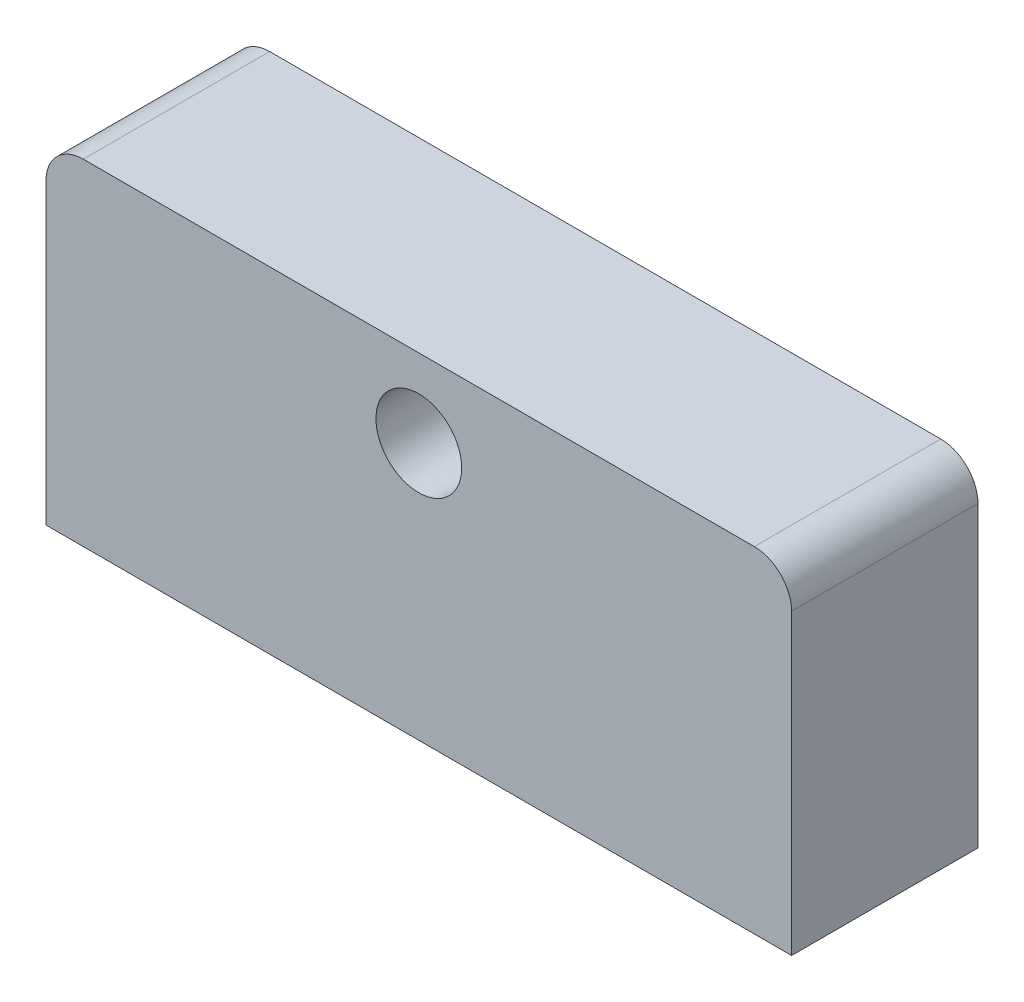
ISO-10303-21;
HEADER;
FILE_DESCRIPTION(('STEP AP214'),'2;1');
FILE_NAME('part.step','',(''),(''),'','','');
FILE_SCHEMA(('AUTOMOTIVE_DESIGN { 1 0 10303 214 1 1 1 1 }'));
ENDSEC;
DATA;
#1=APPLICATION_CONTEXT('core data for automotive mechanical design processes');
#2=APPLICATION_PROTOCOL_DEFINITION('international standard','automotive_design',2000,#1);
#3=PRODUCT_CONTEXT('',#1,'mechanical');
#4=PRODUCT('Part','Part','',(#3));
#5=PRODUCT_RELATED_PRODUCT_CATEGORY('part','',(#4));
#6=PRODUCT_DEFINITION_FORMATION('','',#4);
#7=PRODUCT_DEFINITION_CONTEXT('part definition',#1,'design');
#8=PRODUCT_DEFINITION('design','',#6,#7);
#9=PRODUCT_DEFINITION_SHAPE('','',#8);
#10=(LENGTH_UNIT() NAMED_UNIT(*) SI_UNIT(.MILLI.,.METRE.));
#11=(NAMED_UNIT(*) PLANE_ANGLE_UNIT() SI_UNIT($,.RADIAN.));
#12=(NAMED_UNIT(*) SI_UNIT($,.STERADIAN.) SOLID_ANGLE_UNIT());
#13=UNCERTAINTY_MEASURE_WITH_UNIT(LENGTH_MEASURE(1.E-05),#10,'distance_accuracy_value','');
#14=(GEOMETRIC_REPRESENTATION_CONTEXT(3) GLOBAL_UNCERTAINTY_ASSIGNED_CONTEXT((#13)) GLOBAL_UNIT_ASSIGNED_CONTEXT((#10,
#11,#12)) REPRESENTATION_CONTEXT('',''));
#15=CARTESIAN_POINT('',(0.,0.,0.));
#16=DIRECTION('',(0.,0.,1.));
#17=DIRECTION('',(1.,0.,0.));
#18=AXIS2_PLACEMENT_3D('',#15,#16,#17);
#19=CARTESIAN_POINT('',(0.,0.,25.));
#20=DIRECTION('',(0.,0.,-1.));
#21=DIRECTION('',(-1.,0.,0.));
#22=AXIS2_PLACEMENT_3D('',#19,#20,#21);
#23=PLANE('',#22);
#24=DIRECTION('',(-1.,0.,0.));
#25=VECTOR('',#24,1.);
#26=CARTESIAN_POINT('',(100.,45.,25.));
#27=LINE('',#26,#25);
#28=CARTESIAN_POINT('',(90.,45.,25.));
#29=VERTEX_POINT('',#28);
#30=CARTESIAN_POINT('',(-90.,45.,25.));
#31=VERTEX_POINT('',#30);
#32=EDGE_CURVE('E128',#29,#31,#27,.T.);
#33=ORIENTED_EDGE('',*,*,#32,.T.);
#34=CARTESIAN_POINT('',(-90.,35.,25.));
#35=DIRECTION('',(0.,0.,-1.));
#36=DIRECTION('',(-1.,0.,0.));
#37=AXIS2_PLACEMENT_3D('',#34,#35,#36);
#38=CIRCLE('',#37,10.);
#39=CARTESIAN_POINT('',(-100.,35.,25.));
#40=VERTEX_POINT('',#39);
#41=EDGE_CURVE('E61',#31,#40,#38,.F.);
#42=ORIENTED_EDGE('',*,*,#41,.T.);
#43=DIRECTION('',(0.,1.,0.));
#44=VECTOR('',#43,1.);
#45=CARTESIAN_POINT('',(-100.,-45.,25.));
#46=LINE('',#45,#44);
#47=CARTESIAN_POINT('',(-100.,-45.,25.));
#48=VERTEX_POINT('',#47);
#49=EDGE_CURVE('E112',#48,#40,#46,.T.);
#50=ORIENTED_EDGE('',*,*,#49,.F.);
#51=DIRECTION('',(-1.,0.,0.));
#52=VECTOR('',#51,1.);
#53=CARTESIAN_POINT('',(100.,-45.,25.));
#54=LINE('',#53,#52);
#55=CARTESIAN_POINT('',(100.,-45.,25.));
#56=VERTEX_POINT('',#55);
#57=EDGE_CURVE('E126',#56,#48,#54,.T.);
#58=ORIENTED_EDGE('',*,*,#57,.F.);
#59=DIRECTION('',(0.,1.,0.));
#60=VECTOR('',#59,1.);
#61=CARTESIAN_POINT('',(100.,-45.,25.));
#62=LINE('',#61,#60);
#63=CARTESIAN_POINT('',(100.,35.,25.));
#64=VERTEX_POINT('',#63);
#65=EDGE_CURVE('E131',#56,#64,#62,.T.);
#66=ORIENTED_EDGE('',*,*,#65,.T.);
#67=CARTESIAN_POINT('',(90.,35.,25.));
#68=DIRECTION('',(0.,0.,-1.));
#69=DIRECTION('',(-1.,0.,0.));
#70=AXIS2_PLACEMENT_3D('',#67,#68,#69);
#71=CIRCLE('',#70,10.);
#72=EDGE_CURVE('E154',#64,#29,#71,.F.);
#73=ORIENTED_EDGE('',*,*,#72,.T.);
#74=EDGE_LOOP('',(#33,#42,#50,#58,#66,#73));
#75=FACE_BOUND('',#74,.T.);
#76=CARTESIAN_POINT('',(0.,24.,25.));
#77=DIRECTION('',(0.,0.,1.));
#78=DIRECTION('',(1.,0.,0.));
#79=AXIS2_PLACEMENT_3D('',#76,#77,#78);
#80=CIRCLE('',#79,11.5);
#81=CARTESIAN_POINT('',(11.5,24.,25.));
#82=VERTEX_POINT('',#81);
#83=EDGE_CURVE('E138',#82,#82,#80,.T.);
#84=ORIENTED_EDGE('',*,*,#83,.F.);
#85=EDGE_LOOP('',(#84));
#86=FACE_BOUND('',#85,.T.);
#87=ADVANCED_FACE('F53',(#75,#86),#23,.F.);
#88=CARTESIAN_POINT('',(0.,0.,-25.));
#89=DIRECTION('',(0.,0.,-1.));
#90=DIRECTION('',(-1.,0.,0.));
#91=AXIS2_PLACEMENT_3D('',#88,#89,#90);
#92=PLANE('',#91);
#93=CARTESIAN_POINT('',(15.5,39.5,-25.));
#94=DIRECTION('',(0.,0.,-1.));
#95=DIRECTION('',(-1.,0.,0.));
#96=AXIS2_PLACEMENT_3D('',#93,#94,#95);
#97=CIRCLE('',#96,1.75);
#98=CARTESIAN_POINT('',(13.75,39.5,-25.));
#99=VERTEX_POINT('',#98);
#100=EDGE_CURVE('E236',#99,#99,#97,.T.);
#101=ORIENTED_EDGE('',*,*,#100,.F.);
#102=EDGE_LOOP('',(#101));
#103=FACE_BOUND('',#102,.T.);
#104=CARTESIAN_POINT('',(-15.5,39.5,-25.));
#105=DIRECTION('',(0.,0.,-1.));
#106=DIRECTION('',(-1.,0.,0.));
#107=AXIS2_PLACEMENT_3D('',#104,#105,#106);
#108=CIRCLE('',#107,1.75);
#109=CARTESIAN_POINT('',(-17.25,39.5,-25.));
#110=VERTEX_POINT('',#109);
#111=EDGE_CURVE('E261',#110,#110,#108,.T.);
#112=ORIENTED_EDGE('',*,*,#111,.F.);
#113=EDGE_LOOP('',(#112));
#114=FACE_BOUND('',#113,.T.);
#115=CARTESIAN_POINT('',(-15.5,8.50000000000001,-25.));
#116=DIRECTION('',(0.,0.,-1.));
#117=DIRECTION('',(-1.,0.,0.));
#118=AXIS2_PLACEMENT_3D('',#115,#116,#117);
#119=CIRCLE('',#118,1.75);
#120=CARTESIAN_POINT('',(-17.25,8.50000000000001,-25.));
#121=VERTEX_POINT('',#120);
#122=EDGE_CURVE('E255',#121,#121,#119,.T.);
#123=ORIENTED_EDGE('',*,*,#122,.F.);
#124=EDGE_LOOP('',(#123));
#125=FACE_BOUND('',#124,.T.);
#126=CARTESIAN_POINT('',(15.5,8.50000000000001,-25.));
#127=DIRECTION('',(0.,0.,-1.));
#128=DIRECTION('',(-1.,0.,0.));
#129=AXIS2_PLACEMENT_3D('',#126,#127,#128);
#130=CIRCLE('',#129,1.75);
#131=CARTESIAN_POINT('',(13.75,8.50000000000001,-25.));
#132=VERTEX_POINT('',#131);
#133=EDGE_CURVE('E254',#132,#132,#130,.T.);
#134=ORIENTED_EDGE('',*,*,#133,.F.);
#135=EDGE_LOOP('',(#134));
#136=FACE_BOUND('',#135,.T.);
#137=DIRECTION('',(0.,1.,0.));
#138=VECTOR('',#137,1.);
#139=CARTESIAN_POINT('',(-100.,-45.,-25.));
#140=LINE('',#139,#138);
#141=CARTESIAN_POINT('',(-100.,-45.,-25.));
#142=VERTEX_POINT('',#141);
#143=CARTESIAN_POINT('',(-100.,35.,-25.));
#144=VERTEX_POINT('',#143);
#145=EDGE_CURVE('E115',#142,#144,#140,.T.);
#146=ORIENTED_EDGE('',*,*,#145,.T.);
#147=CARTESIAN_POINT('',(-90.,35.,-25.));
#148=DIRECTION('',(0.,0.,-1.));
#149=DIRECTION('',(-1.,0.,0.));
#150=AXIS2_PLACEMENT_3D('',#147,#148,#149);
#151=CIRCLE('',#150,10.);
#152=CARTESIAN_POINT('',(-90.,45.,-25.));
#153=VERTEX_POINT('',#152);
#154=EDGE_CURVE('E148',#144,#153,#151,.T.);
#155=ORIENTED_EDGE('',*,*,#154,.T.);
#156=DIRECTION('',(-1.,0.,0.));
#157=VECTOR('',#156,1.);
#158=CARTESIAN_POINT('',(100.,45.,-25.));
#159=LINE('',#158,#157);
#160=CARTESIAN_POINT('',(90.,45.,-25.));
#161=VERTEX_POINT('',#160);
#162=EDGE_CURVE('E136',#161,#153,#159,.T.);
#163=ORIENTED_EDGE('',*,*,#162,.F.);
#164=CARTESIAN_POINT('',(90.,35.,-25.));
#165=DIRECTION('',(0.,0.,-1.));
#166=DIRECTION('',(-1.,0.,0.));
#167=AXIS2_PLACEMENT_3D('',#164,#165,#166);
#168=CIRCLE('',#167,10.);
#169=CARTESIAN_POINT('',(100.,35.,-25.));
#170=VERTEX_POINT('',#169);
#171=EDGE_CURVE('E146',#161,#170,#168,.T.);
#172=ORIENTED_EDGE('',*,*,#171,.T.);
#173=DIRECTION('',(0.,1.,0.));
#174=VECTOR('',#173,1.);
#175=CARTESIAN_POINT('',(100.,-45.,-25.));
#176=LINE('',#175,#174);
#177=CARTESIAN_POINT('',(100.,-45.,-25.));
#178=VERTEX_POINT('',#177);
#179=EDGE_CURVE('E142',#178,#170,#176,.T.);
#180=ORIENTED_EDGE('',*,*,#179,.F.);
#181=DIRECTION('',(-1.,0.,0.));
#182=VECTOR('',#181,1.);
#183=CARTESIAN_POINT('',(100.,-45.,-25.));
#184=LINE('',#183,#182);
#185=EDGE_CURVE('E140',#178,#142,#184,.T.);
#186=ORIENTED_EDGE('',*,*,#185,.T.);
#187=EDGE_LOOP('',(#146,#155,#163,#172,#180,#186));
#188=FACE_BOUND('',#187,.T.);
#189=CARTESIAN_POINT('',(0.,24.,-25.));
#190=DIRECTION('',(0.,0.,1.));
#191=DIRECTION('',(1.,0.,0.));
#192=AXIS2_PLACEMENT_3D('',#189,#190,#191);
#193=CIRCLE('',#192,11.5);
#194=CARTESIAN_POINT('',(11.5,24.,-25.));
#195=VERTEX_POINT('',#194);
#196=EDGE_CURVE('E269',#195,#195,#193,.T.);
#197=ORIENTED_EDGE('',*,*,#196,.T.);
#198=EDGE_LOOP('',(#197));
#199=FACE_BOUND('',#198,.T.);
#200=ADVANCED_FACE('F162',(#103,#114,#125,#136,#188,#199),#92,.T.);
#201=CARTESIAN_POINT('',(100.,45.,25.));
#202=DIRECTION('',(0.,-1.,0.));
#203=DIRECTION('',(1.,0.,0.));
#204=AXIS2_PLACEMENT_3D('',#201,#202,#203);
#205=PLANE('',#204);
#206=ORIENTED_EDGE('',*,*,#162,.T.);
#207=DIRECTION('',(0.,0.,-1.));
#208=VECTOR('',#207,1.);
#209=CARTESIAN_POINT('',(-90.,45.,25.));
#210=LINE('',#209,#208);
#211=EDGE_CURVE('E74',#153,#31,#210,.F.);
#212=ORIENTED_EDGE('',*,*,#211,.T.);
#213=ORIENTED_EDGE('',*,*,#32,.F.);
#214=DIRECTION('',(0.,0.,-1.));
#215=VECTOR('',#214,1.);
#216=CARTESIAN_POINT('',(90.,45.,25.));
#217=LINE('',#216,#215);
#218=EDGE_CURVE('E150',#29,#161,#217,.T.);
#219=ORIENTED_EDGE('',*,*,#218,.T.);
#220=EDGE_LOOP('',(#206,#212,#213,#219));
#221=FACE_BOUND('',#220,.T.);
#222=ADVANCED_FACE('F158',(#221),#205,.F.);
#223=CARTESIAN_POINT('',(-100.,-45.,25.));
#224=DIRECTION('',(-1.,0.,0.));
#225=DIRECTION('',(0.,0.,1.));
#226=AXIS2_PLACEMENT_3D('',#223,#224,#225);
#227=PLANE('',#226);
#228=ORIENTED_EDGE('',*,*,#49,.T.);
#229=DIRECTION('',(0.,0.,-1.));
#230=VECTOR('',#229,1.);
#231=CARTESIAN_POINT('',(-100.,35.,-25.));
#232=LINE('',#231,#230);
#233=EDGE_CURVE('E120',#40,#144,#232,.T.);
#234=ORIENTED_EDGE('',*,*,#233,.T.);
#235=ORIENTED_EDGE('',*,*,#145,.F.);
#236=DIRECTION('',(0.,0.,-1.));
#237=VECTOR('',#236,1.);
#238=CARTESIAN_POINT('',(-100.,-45.,25.));
#239=LINE('',#238,#237);
#240=EDGE_CURVE('E108',#48,#142,#239,.T.);
#241=ORIENTED_EDGE('',*,*,#240,.F.);
#242=EDGE_LOOP('',(#228,#234,#235,#241));
#243=FACE_BOUND('',#242,.T.);
#244=ADVANCED_FACE('F110',(#243),#227,.T.);
#245=CARTESIAN_POINT('',(100.,-45.,25.));
#246=DIRECTION('',(0.,-1.,0.));
#247=DIRECTION('',(1.,0.,0.));
#248=AXIS2_PLACEMENT_3D('',#245,#246,#247);
#249=PLANE('',#248);
#250=CARTESIAN_POINT('',(-50.,-45.,0.));
#251=DIRECTION('',(0.,-1.,0.));
#252=DIRECTION('',(1.,0.,0.));
#253=AXIS2_PLACEMENT_3D('',#250,#251,#252);
#254=CIRCLE('',#253,5.);
#255=CARTESIAN_POINT('',(-45.,-45.,0.));
#256=VERTEX_POINT('',#255);
#257=EDGE_CURVE('E237',#256,#256,#254,.T.);
#258=ORIENTED_EDGE('',*,*,#257,.F.);
#259=EDGE_LOOP('',(#258));
#260=FACE_BOUND('',#259,.T.);
#261=CARTESIAN_POINT('',(50.,-45.,0.));
#262=DIRECTION('',(0.,-1.,0.));
#263=DIRECTION('',(1.,0.,0.));
#264=AXIS2_PLACEMENT_3D('',#261,#262,#263);
#265=CIRCLE('',#264,5.);
#266=CARTESIAN_POINT('',(55.,-45.,0.));
#267=VERTEX_POINT('',#266);
#268=EDGE_CURVE('E248',#267,#267,#265,.T.);
#269=ORIENTED_EDGE('',*,*,#268,.F.);
#270=EDGE_LOOP('',(#269));
#271=FACE_BOUND('',#270,.T.);
#272=ORIENTED_EDGE('',*,*,#185,.F.);
#273=DIRECTION('',(0.,0.,-1.));
#274=VECTOR('',#273,1.);
#275=CARTESIAN_POINT('',(100.,-45.,25.));
#276=LINE('',#275,#274);
#277=EDGE_CURVE('E121',#56,#178,#276,.T.);
#278=ORIENTED_EDGE('',*,*,#277,.F.);
#279=ORIENTED_EDGE('',*,*,#57,.T.);
#280=ORIENTED_EDGE('',*,*,#240,.T.);
#281=EDGE_LOOP('',(#272,#278,#279,#280));
#282=FACE_BOUND('',#281,.T.);
#283=ADVANCED_FACE('F130',(#260,#271,#282),#249,.T.);
#284=CARTESIAN_POINT('',(100.,-45.,25.));
#285=DIRECTION('',(-1.,0.,0.));
#286=DIRECTION('',(0.,0.,1.));
#287=AXIS2_PLACEMENT_3D('',#284,#285,#286);
#288=PLANE('',#287);
#289=ORIENTED_EDGE('',*,*,#179,.T.);
#290=DIRECTION('',(0.,0.,-1.));
#291=VECTOR('',#290,1.);
#292=CARTESIAN_POINT('',(100.,35.,25.));
#293=LINE('',#292,#291);
#294=EDGE_CURVE('E12',#170,#64,#293,.F.);
#295=ORIENTED_EDGE('',*,*,#294,.T.);
#296=ORIENTED_EDGE('',*,*,#65,.F.);
#297=ORIENTED_EDGE('',*,*,#277,.T.);
#298=EDGE_LOOP('',(#289,#295,#296,#297));
#299=FACE_BOUND('',#298,.T.);
#300=ADVANCED_FACE('F164',(#299),#288,.F.);
#301=CARTESIAN_POINT('',(0.,24.,25.));
#302=DIRECTION('',(0.,0.,-1.));
#303=DIRECTION('',(-1.,0.,0.));
#304=AXIS2_PLACEMENT_3D('',#301,#302,#303);
#305=CYLINDRICAL_SURFACE('',#304,11.5);
#306=ORIENTED_EDGE('',*,*,#83,.T.);
#307=EDGE_LOOP('',(#306));
#308=FACE_BOUND('',#307,.T.);
#309=ORIENTED_EDGE('',*,*,#196,.F.);
#310=EDGE_LOOP('',(#309));
#311=FACE_BOUND('',#310,.T.);
#312=ADVANCED_FACE('F166',(#308,#311),#305,.F.);
#313=CARTESIAN_POINT('',(15.5,8.50000000000001,-15.));
#314=DIRECTION('',(0.,0.,-1.));
#315=DIRECTION('',(-1.,0.,0.));
#316=AXIS2_PLACEMENT_3D('',#313,#314,#315);
#317=CYLINDRICAL_SURFACE('',#316,1.75);
#318=CARTESIAN_POINT('',(15.5,8.50000000000001,-15.));
#319=DIRECTION('',(0.,0.,-1.));
#320=DIRECTION('',(-1.,0.,0.));
#321=AXIS2_PLACEMENT_3D('',#318,#319,#320);
#322=CIRCLE('',#321,1.75);
#323=CARTESIAN_POINT('',(13.75,8.50000000000001,-15.));
#324=VERTEX_POINT('',#323);
#325=EDGE_CURVE('E266',#324,#324,#322,.T.);
#326=ORIENTED_EDGE('',*,*,#325,.F.);
#327=EDGE_LOOP('',(#326));
#328=FACE_BOUND('',#327,.T.);
#329=ORIENTED_EDGE('',*,*,#133,.T.);
#330=EDGE_LOOP('',(#329));
#331=FACE_BOUND('',#330,.T.);
#332=ADVANCED_FACE('F171',(#328,#331),#317,.F.);
#333=CARTESIAN_POINT('',(15.5,8.50000000000001,-15.));
#334=DIRECTION('',(0.,0.,-1.));
#335=DIRECTION('',(-1.,0.,0.));
#336=AXIS2_PLACEMENT_3D('',#333,#334,#335);
#337=PLANE('',#336);
#338=ORIENTED_EDGE('',*,*,#325,.T.);
#339=EDGE_LOOP('',(#338));
#340=FACE_BOUND('',#339,.T.);
#341=ADVANCED_FACE('F185',(#340),#337,.T.);
#342=CARTESIAN_POINT('',(-15.5,8.50000000000001,-15.));
#343=DIRECTION('',(0.,0.,-1.));
#344=DIRECTION('',(-1.,0.,0.));
#345=AXIS2_PLACEMENT_3D('',#342,#343,#344);
#346=CYLINDRICAL_SURFACE('',#345,1.75);
#347=CARTESIAN_POINT('',(-15.5,8.50000000000001,-15.));
#348=DIRECTION('',(0.,0.,-1.));
#349=DIRECTION('',(-1.,0.,0.));
#350=AXIS2_PLACEMENT_3D('',#347,#348,#349);
#351=CIRCLE('',#350,1.75);
#352=CARTESIAN_POINT('',(-17.25,8.50000000000001,-15.));
#353=VERTEX_POINT('',#352);
#354=EDGE_CURVE('E251',#353,#353,#351,.T.);
#355=ORIENTED_EDGE('',*,*,#354,.F.);
#356=EDGE_LOOP('',(#355));
#357=FACE_BOUND('',#356,.T.);
#358=ORIENTED_EDGE('',*,*,#122,.T.);
#359=EDGE_LOOP('',(#358));
#360=FACE_BOUND('',#359,.T.);
#361=ADVANCED_FACE('F189',(#357,#360),#346,.F.);
#362=CARTESIAN_POINT('',(-15.5,8.50000000000001,-15.));
#363=DIRECTION('',(0.,0.,-1.));
#364=DIRECTION('',(-1.,0.,0.));
#365=AXIS2_PLACEMENT_3D('',#362,#363,#364);
#366=PLANE('',#365);
#367=ORIENTED_EDGE('',*,*,#354,.T.);
#368=EDGE_LOOP('',(#367));
#369=FACE_BOUND('',#368,.T.);
#370=ADVANCED_FACE('F204',(#369),#366,.T.);
#371=CARTESIAN_POINT('',(-15.5,39.5,-15.));
#372=DIRECTION('',(0.,0.,-1.));
#373=DIRECTION('',(-1.,0.,0.));
#374=AXIS2_PLACEMENT_3D('',#371,#372,#373);
#375=CYLINDRICAL_SURFACE('',#374,1.75);
#376=CARTESIAN_POINT('',(-15.5,39.5,-15.));
#377=DIRECTION('',(0.,0.,-1.));
#378=DIRECTION('',(-1.,0.,0.));
#379=AXIS2_PLACEMENT_3D('',#376,#377,#378);
#380=CIRCLE('',#379,1.75);
#381=CARTESIAN_POINT('',(-17.25,39.5,-15.));
#382=VERTEX_POINT('',#381);
#383=EDGE_CURVE('E258',#382,#382,#380,.T.);
#384=ORIENTED_EDGE('',*,*,#383,.F.);
#385=EDGE_LOOP('',(#384));
#386=FACE_BOUND('',#385,.T.);
#387=ORIENTED_EDGE('',*,*,#111,.T.);
#388=EDGE_LOOP('',(#387));
#389=FACE_BOUND('',#388,.T.);
#390=ADVANCED_FACE('F201',(#386,#389),#375,.F.);
#391=CARTESIAN_POINT('',(-15.5,39.5,-15.));
#392=DIRECTION('',(0.,0.,-1.));
#393=DIRECTION('',(-1.,0.,0.));
#394=AXIS2_PLACEMENT_3D('',#391,#392,#393);
#395=PLANE('',#394);
#396=ORIENTED_EDGE('',*,*,#383,.T.);
#397=EDGE_LOOP('',(#396));
#398=FACE_BOUND('',#397,.T.);
#399=ADVANCED_FACE('F195',(#398),#395,.T.);
#400=CARTESIAN_POINT('',(15.5,39.5,-15.));
#401=DIRECTION('',(0.,0.,-1.));
#402=DIRECTION('',(-1.,0.,0.));
#403=AXIS2_PLACEMENT_3D('',#400,#401,#402);
#404=CYLINDRICAL_SURFACE('',#403,1.75);
#405=CARTESIAN_POINT('',(15.5,39.5,-15.));
#406=DIRECTION('',(0.,0.,-1.));
#407=DIRECTION('',(-1.,0.,0.));
#408=AXIS2_PLACEMENT_3D('',#405,#406,#407);
#409=CIRCLE('',#408,1.75);
#410=CARTESIAN_POINT('',(13.75,39.5,-15.));
#411=VERTEX_POINT('',#410);
#412=EDGE_CURVE('E240',#411,#411,#409,.T.);
#413=ORIENTED_EDGE('',*,*,#412,.F.);
#414=EDGE_LOOP('',(#413));
#415=FACE_BOUND('',#414,.T.);
#416=ORIENTED_EDGE('',*,*,#100,.T.);
#417=EDGE_LOOP('',(#416));
#418=FACE_BOUND('',#417,.T.);
#419=ADVANCED_FACE('F191',(#415,#418),#404,.F.);
#420=CARTESIAN_POINT('',(15.5,39.5,-15.));
#421=DIRECTION('',(0.,0.,-1.));
#422=DIRECTION('',(-1.,0.,0.));
#423=AXIS2_PLACEMENT_3D('',#420,#421,#422);
#424=PLANE('',#423);
#425=ORIENTED_EDGE('',*,*,#412,.T.);
#426=EDGE_LOOP('',(#425));
#427=FACE_BOUND('',#426,.T.);
#428=ADVANCED_FACE('F194',(#427),#424,.T.);
#429=CARTESIAN_POINT('',(50.,-30.,0.));
#430=DIRECTION('',(0.,-1.,0.));
#431=DIRECTION('',(1.,0.,0.));
#432=AXIS2_PLACEMENT_3D('',#429,#430,#431);
#433=CYLINDRICAL_SURFACE('',#432,5.);
#434=CARTESIAN_POINT('',(50.,-30.,0.));
#435=DIRECTION('',(0.,-1.,0.));
#436=DIRECTION('',(1.,0.,0.));
#437=AXIS2_PLACEMENT_3D('',#434,#435,#436);
#438=CIRCLE('',#437,5.);
#439=CARTESIAN_POINT('',(55.,-30.,0.));
#440=VERTEX_POINT('',#439);
#441=EDGE_CURVE('E243',#440,#440,#438,.T.);
#442=ORIENTED_EDGE('',*,*,#441,.F.);
#443=EDGE_LOOP('',(#442));
#444=FACE_BOUND('',#443,.T.);
#445=ORIENTED_EDGE('',*,*,#268,.T.);
#446=EDGE_LOOP('',(#445));
#447=FACE_BOUND('',#446,.T.);
#448=ADVANCED_FACE('F199',(#444,#447),#433,.F.);
#449=CARTESIAN_POINT('',(50.,-30.,0.));
#450=DIRECTION('',(0.,-1.,0.));
#451=DIRECTION('',(1.,0.,0.));
#452=AXIS2_PLACEMENT_3D('',#449,#450,#451);
#453=PLANE('',#452);
#454=ORIENTED_EDGE('',*,*,#441,.T.);
#455=EDGE_LOOP('',(#454));
#456=FACE_BOUND('',#455,.T.);
#457=ADVANCED_FACE('F217',(#456),#453,.T.);
#458=CARTESIAN_POINT('',(-50.,-30.,0.));
#459=DIRECTION('',(0.,-1.,0.));
#460=DIRECTION('',(1.,0.,0.));
#461=AXIS2_PLACEMENT_3D('',#458,#459,#460);
#462=CYLINDRICAL_SURFACE('',#461,5.);
#463=CARTESIAN_POINT('',(-50.,-30.,0.));
#464=DIRECTION('',(0.,-1.,0.));
#465=DIRECTION('',(1.,0.,0.));
#466=AXIS2_PLACEMENT_3D('',#463,#464,#465);
#467=CIRCLE('',#466,5.);
#468=CARTESIAN_POINT('',(-45.,-30.,0.));
#469=VERTEX_POINT('',#468);
#470=EDGE_CURVE('E235',#469,#469,#467,.T.);
#471=ORIENTED_EDGE('',*,*,#470,.F.);
#472=EDGE_LOOP('',(#471));
#473=FACE_BOUND('',#472,.T.);
#474=ORIENTED_EDGE('',*,*,#257,.T.);
#475=EDGE_LOOP('',(#474));
#476=FACE_BOUND('',#475,.T.);
#477=ADVANCED_FACE('F221',(#473,#476),#462,.F.);
#478=CARTESIAN_POINT('',(-50.,-30.,0.));
#479=DIRECTION('',(0.,-1.,0.));
#480=DIRECTION('',(1.,0.,0.));
#481=AXIS2_PLACEMENT_3D('',#478,#479,#480);
#482=PLANE('',#481);
#483=ORIENTED_EDGE('',*,*,#470,.T.);
#484=EDGE_LOOP('',(#483));
#485=FACE_BOUND('',#484,.T.);
#486=ADVANCED_FACE('F225',(#485),#482,.T.);
#487=CARTESIAN_POINT('',(-90.,35.,25.));
#488=DIRECTION('',(0.,0.,1.));
#489=DIRECTION('',(1.,0.,0.));
#490=AXIS2_PLACEMENT_3D('',#487,#488,#489);
#491=CYLINDRICAL_SURFACE('',#490,10.);
#492=ORIENTED_EDGE('',*,*,#41,.F.);
#493=ORIENTED_EDGE('',*,*,#211,.F.);
#494=ORIENTED_EDGE('',*,*,#154,.F.);
#495=ORIENTED_EDGE('',*,*,#233,.F.);
#496=EDGE_LOOP('',(#492,#493,#494,#495));
#497=FACE_BOUND('',#496,.T.);
#498=ADVANCED_FACE('F228',(#497),#491,.T.);
#499=CARTESIAN_POINT('',(90.,35.,25.));
#500=DIRECTION('',(0.,0.,-1.));
#501=DIRECTION('',(-1.,0.,0.));
#502=AXIS2_PLACEMENT_3D('',#499,#500,#501);
#503=CYLINDRICAL_SURFACE('',#502,10.);
#504=ORIENTED_EDGE('',*,*,#72,.F.);
#505=ORIENTED_EDGE('',*,*,#294,.F.);
#506=ORIENTED_EDGE('',*,*,#171,.F.);
#507=ORIENTED_EDGE('',*,*,#218,.F.);
#508=EDGE_LOOP('',(#504,#505,#506,#507));
#509=FACE_BOUND('',#508,.T.);
#510=ADVANCED_FACE('F55',(#509),#503,.T.);
#511=CLOSED_SHELL('',(#87,#200,#222,#244,#283,#300,#312,#332,#341,#361,#370,#390,#399,#419,#428,
#448,#457,#477,#486,#498,#510));
#512=MANIFOLD_SOLID_BREP('B2',#511);
#513=ADVANCED_BREP_SHAPE_REPRESENTATION('',(#18,#512),#14);
#514=SHAPE_DEFINITION_REPRESENTATION(#9,#513);
ENDSEC;
END-ISO-10303-21;
